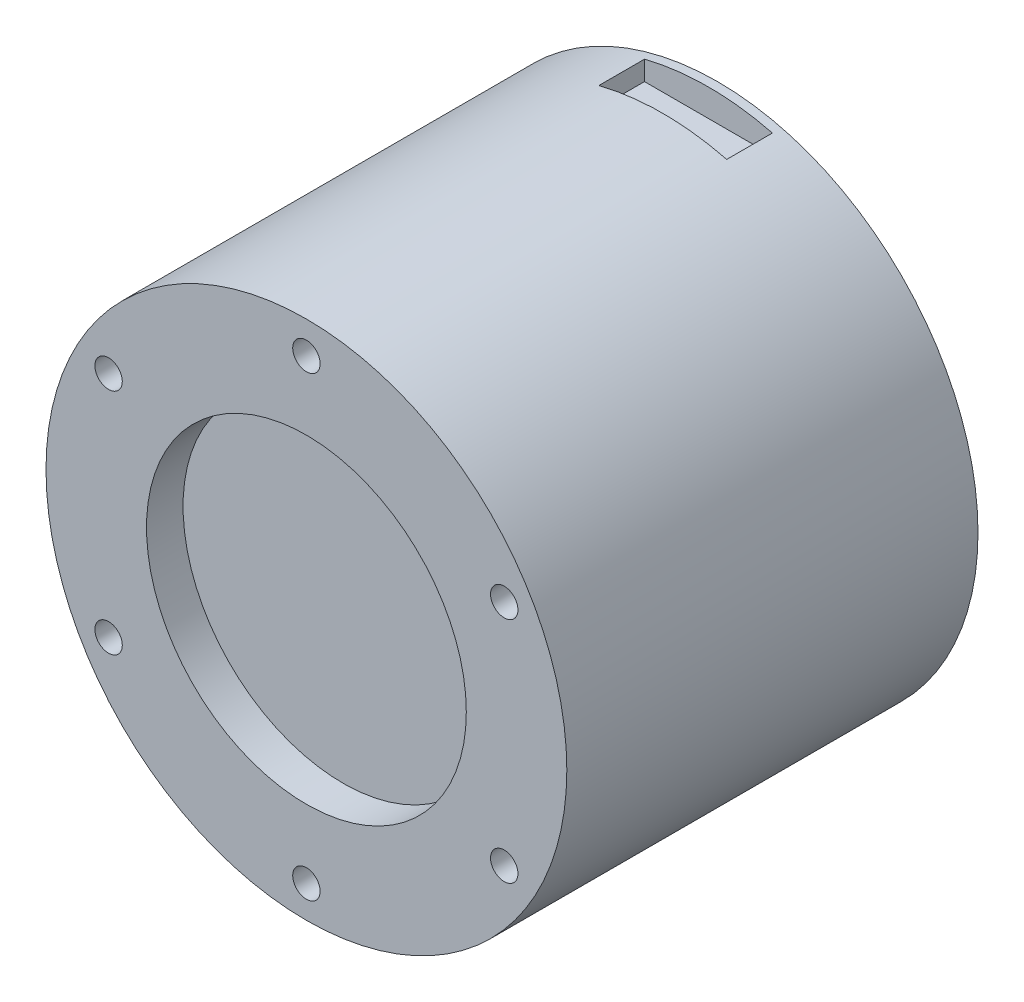
ISO-10303-21;
HEADER;
FILE_DESCRIPTION(('STEP AP214'),'2;1');
FILE_NAME('part.step','',(''),(''),'','','');
FILE_SCHEMA(('AUTOMOTIVE_DESIGN { 1 0 10303 214 1 1 1 1 }'));
ENDSEC;
DATA;
#1=APPLICATION_CONTEXT('core data for automotive mechanical design processes');
#2=APPLICATION_PROTOCOL_DEFINITION('international standard','automotive_design',2000,#1);
#3=PRODUCT_CONTEXT('',#1,'mechanical');
#4=PRODUCT('Part','Part','',(#3));
#5=PRODUCT_RELATED_PRODUCT_CATEGORY('part','',(#4));
#6=PRODUCT_DEFINITION_FORMATION('','',#4);
#7=PRODUCT_DEFINITION_CONTEXT('part definition',#1,'design');
#8=PRODUCT_DEFINITION('design','',#6,#7);
#9=PRODUCT_DEFINITION_SHAPE('','',#8);
#10=(LENGTH_UNIT() NAMED_UNIT(*) SI_UNIT(.MILLI.,.METRE.));
#11=(NAMED_UNIT(*) PLANE_ANGLE_UNIT() SI_UNIT($,.RADIAN.));
#12=(NAMED_UNIT(*) SI_UNIT($,.STERADIAN.) SOLID_ANGLE_UNIT());
#13=UNCERTAINTY_MEASURE_WITH_UNIT(LENGTH_MEASURE(1.E-05),#10,'distance_accuracy_value','');
#14=(GEOMETRIC_REPRESENTATION_CONTEXT(3) GLOBAL_UNCERTAINTY_ASSIGNED_CONTEXT((#13)) GLOBAL_UNIT_ASSIGNED_CONTEXT((#10,
#11,#12)) REPRESENTATION_CONTEXT('',''));
#15=CARTESIAN_POINT('',(0.,0.,0.));
#16=DIRECTION('',(0.,0.,1.));
#17=DIRECTION('',(1.,0.,0.));
#18=AXIS2_PLACEMENT_3D('',#15,#16,#17);
#19=CARTESIAN_POINT('',(0.,0.,45.));
#20=DIRECTION('',(0.,0.,-1.));
#21=DIRECTION('',(-1.,0.,0.));
#22=AXIS2_PLACEMENT_3D('',#19,#20,#21);
#23=CYLINDRICAL_SURFACE('',#22,28.5);
#24=CARTESIAN_POINT('',(6.99999999976047,27.6269795671433,-4.8311518948453));
#25=CARTESIAN_POINT('',(6.99999999986288,27.6269795671173,-2.0541012632302));
#26=CARTESIAN_POINT('',(6.99999999996529,27.6269795670914,0.722949368384905));
#27=CARTESIAN_POINT('',(7.00000000017012,27.6269795670395,6.27705063161511));
#28=CARTESIAN_POINT('',(7.00000000027253,27.6269795670136,9.0541012632302));
#29=CARTESIAN_POINT('',(7.00000000037494,27.6269795669876,11.8311518948453));
#30=B_SPLINE_CURVE_WITH_KNOTS('',3,(#24,#25,#26,#27,#28,#29),.UNSPECIFIED.,.F.,.F.,(4,2,4),(0.,
8.3311518948453,16.6623037896906),.UNSPECIFIED.);
#31=CARTESIAN_POINT('',(6.99999999997551,27.6269795670888,1.));
#32=VERTEX_POINT('',#31);
#33=CARTESIAN_POINT('',(7.0000000001599,27.6269795670421,6.00000000000001));
#34=VERTEX_POINT('',#33);
#35=EDGE_CURVE('E278',#32,#34,#30,.T.);
#36=ORIENTED_EDGE('',*,*,#35,.T.);
#37=CARTESIAN_POINT('',(0.,0.,6.00000000000001));
#38=DIRECTION('',(0.,0.,1.));
#39=DIRECTION('',(1.,0.,0.));
#40=AXIS2_PLACEMENT_3D('',#37,#38,#39);
#41=CIRCLE('',#40,28.5);
#42=CARTESIAN_POINT('',(-6.9999999998401,27.6269795671231,6.));
#43=VERTEX_POINT('',#42);
#44=EDGE_CURVE('E269',#34,#43,#41,.T.);
#45=ORIENTED_EDGE('',*,*,#44,.T.);
#46=DIRECTION('',(0.,0.,-1.));
#47=VECTOR('',#46,1.);
#48=CARTESIAN_POINT('',(-6.99999999984012,27.6269795671231,45.));
#49=LINE('',#48,#47);
#50=CARTESIAN_POINT('',(-6.99999999984012,27.6269795671231,1.00000000000001));
#51=VERTEX_POINT('',#50);
#52=EDGE_CURVE('E275',#43,#51,#49,.T.);
#53=ORIENTED_EDGE('',*,*,#52,.T.);
#54=CARTESIAN_POINT('',(0.,0.,1.));
#55=DIRECTION('',(0.,0.,-1.));
#56=DIRECTION('',(-1.,0.,0.));
#57=AXIS2_PLACEMENT_3D('',#54,#55,#56);
#58=CIRCLE('',#57,28.5);
#59=EDGE_CURVE('E62',#51,#32,#58,.T.);
#60=ORIENTED_EDGE('',*,*,#59,.T.);
#61=EDGE_LOOP('',(#36,#45,#53,#60));
#62=FACE_BOUND('',#61,.T.);
#63=CARTESIAN_POINT('',(0.,0.,45.));
#64=DIRECTION('',(0.,0.,1.));
#65=DIRECTION('',(1.,0.,0.));
#66=AXIS2_PLACEMENT_3D('',#63,#64,#65);
#67=CIRCLE('',#66,28.5);
#68=CARTESIAN_POINT('',(28.5,0.,45.));
#69=VERTEX_POINT('',#68);
#70=EDGE_CURVE('E266',#69,#69,#67,.T.);
#71=ORIENTED_EDGE('',*,*,#70,.F.);
#72=EDGE_LOOP('',(#71));
#73=FACE_BOUND('',#72,.T.);
#74=CARTESIAN_POINT('',(0.,0.,0.));
#75=DIRECTION('',(0.,0.,1.));
#76=DIRECTION('',(1.,0.,0.));
#77=AXIS2_PLACEMENT_3D('',#74,#75,#76);
#78=CIRCLE('',#77,28.5);
#79=CARTESIAN_POINT('',(28.5,0.,0.));
#80=VERTEX_POINT('',#79);
#81=EDGE_CURVE('E263',#80,#80,#78,.T.);
#82=ORIENTED_EDGE('',*,*,#81,.T.);
#83=EDGE_LOOP('',(#82));
#84=FACE_BOUND('',#83,.T.);
#85=CARTESIAN_POINT('',(0.,0.,6.00000000000001));
#86=DIRECTION('',(0.,0.,-1.));
#87=DIRECTION('',(-1.,0.,0.));
#88=AXIS2_PLACEMENT_3D('',#85,#86,#87);
#89=CIRCLE('',#88,28.5);
#90=CARTESIAN_POINT('',(7.0000000001599,-27.6269795670421,6.));
#91=VERTEX_POINT('',#90);
#92=CARTESIAN_POINT('',(-6.9999999998401,-27.6269795671231,6.00000000000001));
#93=VERTEX_POINT('',#92);
#94=EDGE_CURVE('E286',#91,#93,#89,.T.);
#95=ORIENTED_EDGE('',*,*,#94,.F.);
#96=CARTESIAN_POINT('',(6.99999999976047,-27.6269795671433,-4.8311518948453));
#97=CARTESIAN_POINT('',(6.99999999986288,-27.6269795671173,-2.0541012632302));
#98=CARTESIAN_POINT('',(6.99999999996529,-27.6269795670914,0.722949368384905));
#99=CARTESIAN_POINT('',(7.00000000017012,-27.6269795670395,6.27705063161511));
#100=CARTESIAN_POINT('',(7.00000000027253,-27.6269795670136,9.0541012632302));
#101=CARTESIAN_POINT('',(7.00000000037494,-27.6269795669876,11.8311518948453));
#102=B_SPLINE_CURVE_WITH_KNOTS('',3,(#96,#97,#98,#99,#100,#101),.UNSPECIFIED.,.F.,.F.,(4,2,4),
(0.,8.3311518948453,16.6623037896906),.UNSPECIFIED.);
#103=CARTESIAN_POINT('',(6.99999999997551,-27.6269795670888,1.));
#104=VERTEX_POINT('',#103);
#105=EDGE_CURVE('E423',#104,#91,#102,.T.);
#106=ORIENTED_EDGE('',*,*,#105,.F.);
#107=CARTESIAN_POINT('',(0.,0.,1.));
#108=DIRECTION('',(0.,0.,1.));
#109=DIRECTION('',(1.,0.,0.));
#110=AXIS2_PLACEMENT_3D('',#107,#108,#109);
#111=CIRCLE('',#110,28.5);
#112=CARTESIAN_POINT('',(-6.9999999998401,-27.6269795671231,1.));
#113=VERTEX_POINT('',#112);
#114=EDGE_CURVE('E440',#113,#104,#111,.T.);
#115=ORIENTED_EDGE('',*,*,#114,.F.);
#116=DIRECTION('',(0.,0.,-1.));
#117=VECTOR('',#116,1.);
#118=CARTESIAN_POINT('',(-6.99999999984012,-27.6269795671231,45.));
#119=LINE('',#118,#117);
#120=EDGE_CURVE('E462',#93,#113,#119,.T.);
#121=ORIENTED_EDGE('',*,*,#120,.F.);
#122=EDGE_LOOP('',(#95,#106,#115,#121));
#123=FACE_BOUND('',#122,.T.);
#124=CARTESIAN_POINT('',(0.,0.,1.));
#125=DIRECTION('',(0.,0.,1.));
#126=DIRECTION('',(0.,-1.,0.));
#127=AXIS2_PLACEMENT_3D('',#124,#125,#126);
#128=CIRCLE('',#127,28.5);
#129=CARTESIAN_POINT('',(-28.2179021190449,4.,1.));
#130=VERTEX_POINT('',#129);
#131=CARTESIAN_POINT('',(-28.2179021190449,-4.,1.));
#132=VERTEX_POINT('',#131);
#133=EDGE_CURVE('E418',#130,#132,#128,.T.);
#134=ORIENTED_EDGE('',*,*,#133,.F.);
#135=DIRECTION('',(0.,0.,-1.));
#136=VECTOR('',#135,1.);
#137=CARTESIAN_POINT('',(-28.2179021190449,4.,45.));
#138=LINE('',#137,#136);
#139=CARTESIAN_POINT('',(-28.2179021190449,4.,9.));
#140=VERTEX_POINT('',#139);
#141=EDGE_CURVE('E11',#140,#130,#138,.T.);
#142=ORIENTED_EDGE('',*,*,#141,.F.);
#143=CARTESIAN_POINT('',(0.,0.,9.));
#144=DIRECTION('',(0.,0.,-1.));
#145=DIRECTION('',(-1.,0.,0.));
#146=AXIS2_PLACEMENT_3D('',#143,#144,#145);
#147=CIRCLE('',#146,28.5);
#148=CARTESIAN_POINT('',(-28.2179021190449,-4.,9.));
#149=VERTEX_POINT('',#148);
#150=EDGE_CURVE('E47',#149,#140,#147,.T.);
#151=ORIENTED_EDGE('',*,*,#150,.F.);
#152=DIRECTION('',(0.,0.,-1.));
#153=VECTOR('',#152,1.);
#154=CARTESIAN_POINT('',(-28.2179021190449,-4.,45.));
#155=LINE('',#154,#153);
#156=EDGE_CURVE('E419',#132,#149,#155,.F.);
#157=ORIENTED_EDGE('',*,*,#156,.F.);
#158=EDGE_LOOP('',(#134,#142,#151,#157));
#159=FACE_BOUND('',#158,.T.);
#160=ADVANCED_FACE('F39',(#62,#73,#84,#123,#159),#23,.T.);
#161=CARTESIAN_POINT('',(0.,0.,45.));
#162=DIRECTION('',(0.,0.,1.));
#163=DIRECTION('',(1.,0.,0.));
#164=AXIS2_PLACEMENT_3D('',#161,#162,#163);
#165=PLANE('',#164);
#166=CARTESIAN_POINT('',(0.,25.,45.));
#167=DIRECTION('',(0.,0.,1.));
#168=DIRECTION('',(1.,0.,0.));
#169=AXIS2_PLACEMENT_3D('',#166,#167,#168);
#170=CIRCLE('',#169,1.5);
#171=CARTESIAN_POINT('',(1.5,25.,45.));
#172=VERTEX_POINT('',#171);
#173=EDGE_CURVE('E228',#172,#172,#170,.T.);
#174=ORIENTED_EDGE('',*,*,#173,.F.);
#175=EDGE_LOOP('',(#174));
#176=FACE_BOUND('',#175,.T.);
#177=CARTESIAN_POINT('',(-21.6506350946105,12.4999999999991,45.));
#178=DIRECTION('',(0.,0.,1.));
#179=DIRECTION('',(1.,0.,0.));
#180=AXIS2_PLACEMENT_3D('',#177,#178,#179);
#181=CIRCLE('',#180,1.5);
#182=CARTESIAN_POINT('',(-20.1506350946105,12.4999999999991,45.));
#183=VERTEX_POINT('',#182);
#184=EDGE_CURVE('E232',#183,#183,#181,.T.);
#185=ORIENTED_EDGE('',*,*,#184,.F.);
#186=EDGE_LOOP('',(#185));
#187=FACE_BOUND('',#186,.T.);
#188=CARTESIAN_POINT('',(-21.6506350946095,-12.5000000000009,45.));
#189=DIRECTION('',(0.,0.,1.));
#190=DIRECTION('',(1.,0.,0.));
#191=AXIS2_PLACEMENT_3D('',#188,#189,#190);
#192=CIRCLE('',#191,1.5);
#193=CARTESIAN_POINT('',(-20.1506350946095,-12.5000000000009,45.));
#194=VERTEX_POINT('',#193);
#195=EDGE_CURVE('E255',#194,#194,#192,.T.);
#196=ORIENTED_EDGE('',*,*,#195,.F.);
#197=EDGE_LOOP('',(#196));
#198=FACE_BOUND('',#197,.T.);
#199=CARTESIAN_POINT('',(2.01647426932225E-12,-25.,45.));
#200=DIRECTION('',(0.,0.,1.));
#201=DIRECTION('',(1.,0.,0.));
#202=AXIS2_PLACEMENT_3D('',#199,#200,#201);
#203=CIRCLE('',#202,1.5);
#204=CARTESIAN_POINT('',(1.50000000000202,-25.,45.));
#205=VERTEX_POINT('',#204);
#206=EDGE_CURVE('E249',#205,#205,#203,.T.);
#207=ORIENTED_EDGE('',*,*,#206,.F.);
#208=EDGE_LOOP('',(#207));
#209=FACE_BOUND('',#208,.T.);
#210=CARTESIAN_POINT('',(21.6506350946125,-12.4999999999991,45.));
#211=DIRECTION('',(0.,0.,1.));
#212=DIRECTION('',(1.,0.,0.));
#213=AXIS2_PLACEMENT_3D('',#210,#211,#212);
#214=CIRCLE('',#213,1.5);
#215=CARTESIAN_POINT('',(23.1506350946125,-12.4999999999991,45.));
#216=VERTEX_POINT('',#215);
#217=EDGE_CURVE('E243',#216,#216,#214,.T.);
#218=ORIENTED_EDGE('',*,*,#217,.F.);
#219=EDGE_LOOP('',(#218));
#220=FACE_BOUND('',#219,.T.);
#221=CARTESIAN_POINT('',(21.6506350946115,12.5000000000009,45.));
#222=DIRECTION('',(0.,0.,1.));
#223=DIRECTION('',(1.,0.,0.));
#224=AXIS2_PLACEMENT_3D('',#221,#222,#223);
#225=CIRCLE('',#224,1.5);
#226=CARTESIAN_POINT('',(23.1506350946115,12.5000000000009,45.));
#227=VERTEX_POINT('',#226);
#228=EDGE_CURVE('E231',#227,#227,#225,.T.);
#229=ORIENTED_EDGE('',*,*,#228,.F.);
#230=EDGE_LOOP('',(#229));
#231=FACE_BOUND('',#230,.T.);
#232=CARTESIAN_POINT('',(0.,0.,45.));
#233=DIRECTION('',(0.,0.,1.));
#234=DIRECTION('',(1.,0.,0.));
#235=AXIS2_PLACEMENT_3D('',#232,#233,#234);
#236=CIRCLE('',#235,17.5);
#237=CARTESIAN_POINT('',(17.5,0.,45.));
#238=VERTEX_POINT('',#237);
#239=EDGE_CURVE('E227',#238,#238,#236,.T.);
#240=ORIENTED_EDGE('',*,*,#239,.F.);
#241=EDGE_LOOP('',(#240));
#242=FACE_BOUND('',#241,.T.);
#243=ORIENTED_EDGE('',*,*,#70,.T.);
#244=EDGE_LOOP('',(#243));
#245=FACE_BOUND('',#244,.T.);
#246=ADVANCED_FACE('F396',(#176,#187,#198,#209,#220,#231,#242,#245),#165,.T.);
#247=CARTESIAN_POINT('',(0.,0.,0.));
#248=DIRECTION('',(0.,0.,1.));
#249=DIRECTION('',(1.,0.,0.));
#250=AXIS2_PLACEMENT_3D('',#247,#248,#249);
#251=PLANE('',#250);
#252=CARTESIAN_POINT('',(13.4350288425436,-13.4350288425444,0.));
#253=DIRECTION('',(0.,0.,-1.));
#254=DIRECTION('',(-1.,0.,0.));
#255=AXIS2_PLACEMENT_3D('',#252,#253,#254);
#256=CIRCLE('',#255,1.5000000000004);
#257=CARTESIAN_POINT('',(11.9350288425432,-13.4350288425444,0.));
#258=VERTEX_POINT('',#257);
#259=EDGE_CURVE('E213',#258,#258,#256,.T.);
#260=ORIENTED_EDGE('',*,*,#259,.F.);
#261=EDGE_LOOP('',(#260));
#262=FACE_BOUND('',#261,.T.);
#263=CARTESIAN_POINT('',(-13.4350288425452,-13.4350288425436,0.));
#264=DIRECTION('',(0.,0.,-1.));
#265=DIRECTION('',(-1.,0.,0.));
#266=AXIS2_PLACEMENT_3D('',#263,#264,#265);
#267=CIRCLE('',#266,1.50000000000106);
#268=CARTESIAN_POINT('',(-14.9350288425462,-13.4350288425436,0.));
#269=VERTEX_POINT('',#268);
#270=EDGE_CURVE('E207',#269,#269,#267,.T.);
#271=ORIENTED_EDGE('',*,*,#270,.F.);
#272=EDGE_LOOP('',(#271));
#273=FACE_BOUND('',#272,.T.);
#274=CARTESIAN_POINT('',(-13.4350288425444,13.4350288425452,0.));
#275=DIRECTION('',(0.,0.,-1.));
#276=DIRECTION('',(-1.,0.,0.));
#277=AXIS2_PLACEMENT_3D('',#274,#275,#276);
#278=CIRCLE('',#277,1.50000000000078);
#279=CARTESIAN_POINT('',(-14.9350288425452,13.4350288425452,0.));
#280=VERTEX_POINT('',#279);
#281=EDGE_CURVE('E200',#280,#280,#278,.T.);
#282=ORIENTED_EDGE('',*,*,#281,.F.);
#283=EDGE_LOOP('',(#282));
#284=FACE_BOUND('',#283,.T.);
#285=CARTESIAN_POINT('',(13.4350288425444,13.4350288425444,0.));
#286=DIRECTION('',(0.,0.,-1.));
#287=DIRECTION('',(-1.,0.,0.));
#288=AXIS2_PLACEMENT_3D('',#285,#286,#287);
#289=CIRCLE('',#288,1.5);
#290=CARTESIAN_POINT('',(11.9350288425444,13.4350288425444,0.));
#291=VERTEX_POINT('',#290);
#292=EDGE_CURVE('E203',#291,#291,#289,.T.);
#293=ORIENTED_EDGE('',*,*,#292,.F.);
#294=EDGE_LOOP('',(#293));
#295=FACE_BOUND('',#294,.T.);
#296=ORIENTED_EDGE('',*,*,#81,.F.);
#297=EDGE_LOOP('',(#296));
#298=FACE_BOUND('',#297,.T.);
#299=ADVANCED_FACE('F394',(#262,#273,#284,#295,#298),#251,.F.);
#300=CARTESIAN_POINT('',(0.,0.,41.));
#301=DIRECTION('',(0.,0.,1.));
#302=DIRECTION('',(1.,0.,0.));
#303=AXIS2_PLACEMENT_3D('',#300,#301,#302);
#304=CYLINDRICAL_SURFACE('',#303,17.5);
#305=CARTESIAN_POINT('',(0.,0.,41.));
#306=DIRECTION('',(0.,0.,1.));
#307=DIRECTION('',(1.,0.,0.));
#308=AXIS2_PLACEMENT_3D('',#305,#306,#307);
#309=CIRCLE('',#308,17.5);
#310=CARTESIAN_POINT('',(17.5,0.,41.));
#311=VERTEX_POINT('',#310);
#312=EDGE_CURVE('E260',#311,#311,#309,.T.);
#313=ORIENTED_EDGE('',*,*,#312,.F.);
#314=EDGE_LOOP('',(#313));
#315=FACE_BOUND('',#314,.T.);
#316=ORIENTED_EDGE('',*,*,#239,.T.);
#317=EDGE_LOOP('',(#316));
#318=FACE_BOUND('',#317,.T.);
#319=ADVANCED_FACE('F390',(#315,#318),#304,.F.);
#320=CARTESIAN_POINT('',(0.,0.,41.));
#321=DIRECTION('',(0.,0.,1.));
#322=DIRECTION('',(1.,0.,0.));
#323=AXIS2_PLACEMENT_3D('',#320,#321,#322);
#324=PLANE('',#323);
#325=ORIENTED_EDGE('',*,*,#312,.T.);
#326=EDGE_LOOP('',(#325));
#327=FACE_BOUND('',#326,.T.);
#328=ADVANCED_FACE('F360',(#327),#324,.T.);
#329=CARTESIAN_POINT('',(21.6506350946115,12.5000000000009,40.));
#330=DIRECTION('',(0.,0.,1.));
#331=DIRECTION('',(1.,0.,0.));
#332=AXIS2_PLACEMENT_3D('',#329,#330,#331);
#333=CYLINDRICAL_SURFACE('',#332,1.5);
#334=CARTESIAN_POINT('',(21.6506350946115,12.5000000000009,40.));
#335=DIRECTION('',(0.,0.,1.));
#336=DIRECTION('',(1.,0.,0.));
#337=AXIS2_PLACEMENT_3D('',#334,#335,#336);
#338=CIRCLE('',#337,1.5);
#339=CARTESIAN_POINT('',(23.1506350946115,12.5000000000009,40.));
#340=VERTEX_POINT('',#339);
#341=EDGE_CURVE('E240',#340,#340,#338,.T.);
#342=ORIENTED_EDGE('',*,*,#341,.F.);
#343=EDGE_LOOP('',(#342));
#344=FACE_BOUND('',#343,.T.);
#345=ORIENTED_EDGE('',*,*,#228,.T.);
#346=EDGE_LOOP('',(#345));
#347=FACE_BOUND('',#346,.T.);
#348=ADVANCED_FACE('F356',(#344,#347),#333,.F.);
#349=CARTESIAN_POINT('',(21.6506350946115,12.5000000000009,40.));
#350=DIRECTION('',(0.,0.,1.));
#351=DIRECTION('',(1.,0.,0.));
#352=AXIS2_PLACEMENT_3D('',#349,#350,#351);
#353=PLANE('',#352);
#354=ORIENTED_EDGE('',*,*,#341,.T.);
#355=EDGE_LOOP('',(#354));
#356=FACE_BOUND('',#355,.T.);
#357=ADVANCED_FACE('F359',(#356),#353,.T.);
#358=CARTESIAN_POINT('',(21.6506350946125,-12.4999999999991,40.));
#359=DIRECTION('',(0.,0.,1.));
#360=DIRECTION('',(1.,0.,0.));
#361=AXIS2_PLACEMENT_3D('',#358,#359,#360);
#362=CYLINDRICAL_SURFACE('',#361,1.5);
#363=CARTESIAN_POINT('',(21.6506350946125,-12.4999999999991,40.));
#364=DIRECTION('',(0.,0.,1.));
#365=DIRECTION('',(1.,0.,0.));
#366=AXIS2_PLACEMENT_3D('',#363,#364,#365);
#367=CIRCLE('',#366,1.5);
#368=CARTESIAN_POINT('',(23.1506350946125,-12.4999999999991,40.));
#369=VERTEX_POINT('',#368);
#370=EDGE_CURVE('E246',#369,#369,#367,.T.);
#371=ORIENTED_EDGE('',*,*,#370,.F.);
#372=EDGE_LOOP('',(#371));
#373=FACE_BOUND('',#372,.T.);
#374=ORIENTED_EDGE('',*,*,#217,.T.);
#375=EDGE_LOOP('',(#374));
#376=FACE_BOUND('',#375,.T.);
#377=ADVANCED_FACE('F364',(#373,#376),#362,.F.);
#378=CARTESIAN_POINT('',(21.6506350946125,-12.4999999999991,40.));
#379=DIRECTION('',(0.,0.,1.));
#380=DIRECTION('',(1.,0.,0.));
#381=AXIS2_PLACEMENT_3D('',#378,#379,#380);
#382=PLANE('',#381);
#383=ORIENTED_EDGE('',*,*,#370,.T.);
#384=EDGE_LOOP('',(#383));
#385=FACE_BOUND('',#384,.T.);
#386=ADVANCED_FACE('F368',(#385),#382,.T.);
#387=CARTESIAN_POINT('',(2.01647426932225E-12,-25.,40.));
#388=DIRECTION('',(0.,0.,1.));
#389=DIRECTION('',(1.,0.,0.));
#390=AXIS2_PLACEMENT_3D('',#387,#388,#389);
#391=CYLINDRICAL_SURFACE('',#390,1.5);
#392=CARTESIAN_POINT('',(2.01647426932225E-12,-25.,40.));
#393=DIRECTION('',(0.,0.,1.));
#394=DIRECTION('',(1.,0.,0.));
#395=AXIS2_PLACEMENT_3D('',#392,#393,#394);
#396=CIRCLE('',#395,1.5);
#397=CARTESIAN_POINT('',(1.50000000000202,-25.,40.));
#398=VERTEX_POINT('',#397);
#399=EDGE_CURVE('E252',#398,#398,#396,.T.);
#400=ORIENTED_EDGE('',*,*,#399,.F.);
#401=EDGE_LOOP('',(#400));
#402=FACE_BOUND('',#401,.T.);
#403=ORIENTED_EDGE('',*,*,#206,.T.);
#404=EDGE_LOOP('',(#403));
#405=FACE_BOUND('',#404,.T.);
#406=ADVANCED_FACE('F372',(#402,#405),#391,.F.);
#407=CARTESIAN_POINT('',(2.01647426932225E-12,-25.,40.));
#408=DIRECTION('',(0.,0.,1.));
#409=DIRECTION('',(1.,0.,0.));
#410=AXIS2_PLACEMENT_3D('',#407,#408,#409);
#411=PLANE('',#410);
#412=ORIENTED_EDGE('',*,*,#399,.T.);
#413=EDGE_LOOP('',(#412));
#414=FACE_BOUND('',#413,.T.);
#415=ADVANCED_FACE('F376',(#414),#411,.T.);
#416=CARTESIAN_POINT('',(-21.6506350946095,-12.5000000000009,40.));
#417=DIRECTION('',(0.,0.,1.));
#418=DIRECTION('',(1.,0.,0.));
#419=AXIS2_PLACEMENT_3D('',#416,#417,#418);
#420=CYLINDRICAL_SURFACE('',#419,1.5);
#421=CARTESIAN_POINT('',(-21.6506350946095,-12.5000000000009,40.));
#422=DIRECTION('',(0.,0.,1.));
#423=DIRECTION('',(1.,0.,0.));
#424=AXIS2_PLACEMENT_3D('',#421,#422,#423);
#425=CIRCLE('',#424,1.5);
#426=CARTESIAN_POINT('',(-20.1506350946095,-12.5000000000009,40.));
#427=VERTEX_POINT('',#426);
#428=EDGE_CURVE('E235',#427,#427,#425,.T.);
#429=ORIENTED_EDGE('',*,*,#428,.F.);
#430=EDGE_LOOP('',(#429));
#431=FACE_BOUND('',#430,.T.);
#432=ORIENTED_EDGE('',*,*,#195,.T.);
#433=EDGE_LOOP('',(#432));
#434=FACE_BOUND('',#433,.T.);
#435=ADVANCED_FACE('F380',(#431,#434),#420,.F.);
#436=CARTESIAN_POINT('',(-21.6506350946095,-12.5000000000009,40.));
#437=DIRECTION('',(0.,0.,1.));
#438=DIRECTION('',(1.,0.,0.));
#439=AXIS2_PLACEMENT_3D('',#436,#437,#438);
#440=PLANE('',#439);
#441=ORIENTED_EDGE('',*,*,#428,.T.);
#442=EDGE_LOOP('',(#441));
#443=FACE_BOUND('',#442,.T.);
#444=ADVANCED_FACE('F351',(#443),#440,.T.);
#445=CARTESIAN_POINT('',(-21.6506350946105,12.4999999999991,40.));
#446=DIRECTION('',(0.,0.,1.));
#447=DIRECTION('',(1.,0.,0.));
#448=AXIS2_PLACEMENT_3D('',#445,#446,#447);
#449=CYLINDRICAL_SURFACE('',#448,1.5);
#450=CARTESIAN_POINT('',(-21.6506350946105,12.4999999999991,40.));
#451=DIRECTION('',(0.,0.,1.));
#452=DIRECTION('',(1.,0.,0.));
#453=AXIS2_PLACEMENT_3D('',#450,#451,#452);
#454=CIRCLE('',#453,1.5);
#455=CARTESIAN_POINT('',(-20.1506350946105,12.4999999999991,40.));
#456=VERTEX_POINT('',#455);
#457=EDGE_CURVE('E221',#456,#456,#454,.T.);
#458=ORIENTED_EDGE('',*,*,#457,.F.);
#459=EDGE_LOOP('',(#458));
#460=FACE_BOUND('',#459,.T.);
#461=ORIENTED_EDGE('',*,*,#184,.T.);
#462=EDGE_LOOP('',(#461));
#463=FACE_BOUND('',#462,.T.);
#464=ADVANCED_FACE('F348',(#460,#463),#449,.F.);
#465=CARTESIAN_POINT('',(-21.6506350946105,12.4999999999991,40.));
#466=DIRECTION('',(0.,0.,1.));
#467=DIRECTION('',(1.,0.,0.));
#468=AXIS2_PLACEMENT_3D('',#465,#466,#467);
#469=PLANE('',#468);
#470=ORIENTED_EDGE('',*,*,#457,.T.);
#471=EDGE_LOOP('',(#470));
#472=FACE_BOUND('',#471,.T.);
#473=ADVANCED_FACE('F346',(#472),#469,.T.);
#474=CARTESIAN_POINT('',(0.,25.,40.));
#475=DIRECTION('',(0.,0.,1.));
#476=DIRECTION('',(1.,0.,0.));
#477=AXIS2_PLACEMENT_3D('',#474,#475,#476);
#478=CYLINDRICAL_SURFACE('',#477,1.5);
#479=CARTESIAN_POINT('',(0.,25.,40.));
#480=DIRECTION('',(0.,0.,1.));
#481=DIRECTION('',(1.,0.,0.));
#482=AXIS2_PLACEMENT_3D('',#479,#480,#481);
#483=CIRCLE('',#482,1.5);
#484=CARTESIAN_POINT('',(1.5,25.,40.));
#485=VERTEX_POINT('',#484);
#486=EDGE_CURVE('E224',#485,#485,#483,.T.);
#487=ORIENTED_EDGE('',*,*,#486,.F.);
#488=EDGE_LOOP('',(#487));
#489=FACE_BOUND('',#488,.T.);
#490=ORIENTED_EDGE('',*,*,#173,.T.);
#491=EDGE_LOOP('',(#490));
#492=FACE_BOUND('',#491,.T.);
#493=ADVANCED_FACE('F342',(#489,#492),#478,.F.);
#494=CARTESIAN_POINT('',(0.,25.,40.));
#495=DIRECTION('',(0.,0.,1.));
#496=DIRECTION('',(1.,0.,0.));
#497=AXIS2_PLACEMENT_3D('',#494,#495,#496);
#498=PLANE('',#497);
#499=ORIENTED_EDGE('',*,*,#486,.T.);
#500=EDGE_LOOP('',(#499));
#501=FACE_BOUND('',#500,.T.);
#502=ADVANCED_FACE('F338',(#501),#498,.T.);
#503=CARTESIAN_POINT('',(13.4350288425444,13.4350288425444,4.));
#504=DIRECTION('',(0.,0.,-1.));
#505=DIRECTION('',(-1.,0.,0.));
#506=AXIS2_PLACEMENT_3D('',#503,#504,#505);
#507=CYLINDRICAL_SURFACE('',#506,1.5);
#508=CARTESIAN_POINT('',(13.4350288425444,13.4350288425444,4.));
#509=DIRECTION('',(0.,0.,-1.));
#510=DIRECTION('',(-1.,0.,0.));
#511=AXIS2_PLACEMENT_3D('',#508,#509,#510);
#512=CIRCLE('',#511,1.5);
#513=CARTESIAN_POINT('',(11.9350288425444,13.4350288425444,4.));
#514=VERTEX_POINT('',#513);
#515=EDGE_CURVE('E218',#514,#514,#512,.T.);
#516=ORIENTED_EDGE('',*,*,#515,.F.);
#517=EDGE_LOOP('',(#516));
#518=FACE_BOUND('',#517,.T.);
#519=ORIENTED_EDGE('',*,*,#292,.T.);
#520=EDGE_LOOP('',(#519));
#521=FACE_BOUND('',#520,.T.);
#522=ADVANCED_FACE('F334',(#518,#521),#507,.F.);
#523=CARTESIAN_POINT('',(13.4350288425444,13.4350288425444,4.));
#524=DIRECTION('',(0.,0.,-1.));
#525=DIRECTION('',(-1.,0.,0.));
#526=AXIS2_PLACEMENT_3D('',#523,#524,#525);
#527=PLANE('',#526);
#528=ORIENTED_EDGE('',*,*,#515,.T.);
#529=EDGE_LOOP('',(#528));
#530=FACE_BOUND('',#529,.T.);
#531=ADVANCED_FACE('F312',(#530),#527,.T.);
#532=CARTESIAN_POINT('',(-13.4350288425444,13.4350288425452,4.));
#533=DIRECTION('',(0.,0.,-1.));
#534=DIRECTION('',(-1.,0.,0.));
#535=AXIS2_PLACEMENT_3D('',#532,#533,#534);
#536=CYLINDRICAL_SURFACE('',#535,1.50000000000078);
#537=CARTESIAN_POINT('',(-13.4350288425444,13.4350288425452,4.));
#538=DIRECTION('',(0.,0.,-1.));
#539=DIRECTION('',(-1.,0.,0.));
#540=AXIS2_PLACEMENT_3D('',#537,#538,#539);
#541=CIRCLE('',#540,1.50000000000078);
#542=CARTESIAN_POINT('',(-14.9350288425452,13.4350288425452,4.));
#543=VERTEX_POINT('',#542);
#544=EDGE_CURVE('E204',#543,#543,#541,.T.);
#545=ORIENTED_EDGE('',*,*,#544,.F.);
#546=EDGE_LOOP('',(#545));
#547=FACE_BOUND('',#546,.T.);
#548=ORIENTED_EDGE('',*,*,#281,.T.);
#549=EDGE_LOOP('',(#548));
#550=FACE_BOUND('',#549,.T.);
#551=ADVANCED_FACE('F308',(#547,#550),#536,.F.);
#552=CARTESIAN_POINT('',(-13.4350288425444,13.4350288425452,4.));
#553=DIRECTION('',(0.,0.,-1.));
#554=DIRECTION('',(-1.,0.,0.));
#555=AXIS2_PLACEMENT_3D('',#552,#553,#554);
#556=PLANE('',#555);
#557=ORIENTED_EDGE('',*,*,#544,.T.);
#558=EDGE_LOOP('',(#557));
#559=FACE_BOUND('',#558,.T.);
#560=ADVANCED_FACE('F311',(#559),#556,.T.);
#561=CARTESIAN_POINT('',(-13.4350288425452,-13.4350288425436,4.));
#562=DIRECTION('',(0.,0.,-1.));
#563=DIRECTION('',(-1.,0.,0.));
#564=AXIS2_PLACEMENT_3D('',#561,#562,#563);
#565=CYLINDRICAL_SURFACE('',#564,1.50000000000106);
#566=CARTESIAN_POINT('',(-13.4350288425452,-13.4350288425436,4.));
#567=DIRECTION('',(0.,0.,-1.));
#568=DIRECTION('',(-1.,0.,0.));
#569=AXIS2_PLACEMENT_3D('',#566,#567,#568);
#570=CIRCLE('',#569,1.50000000000106);
#571=CARTESIAN_POINT('',(-14.9350288425462,-13.4350288425436,4.));
#572=VERTEX_POINT('',#571);
#573=EDGE_CURVE('E210',#572,#572,#570,.T.);
#574=ORIENTED_EDGE('',*,*,#573,.F.);
#575=EDGE_LOOP('',(#574));
#576=FACE_BOUND('',#575,.T.);
#577=ORIENTED_EDGE('',*,*,#270,.T.);
#578=EDGE_LOOP('',(#577));
#579=FACE_BOUND('',#578,.T.);
#580=ADVANCED_FACE('F316',(#576,#579),#565,.F.);
#581=CARTESIAN_POINT('',(-13.4350288425452,-13.4350288425436,4.));
#582=DIRECTION('',(0.,0.,-1.));
#583=DIRECTION('',(-1.,0.,0.));
#584=AXIS2_PLACEMENT_3D('',#581,#582,#583);
#585=PLANE('',#584);
#586=ORIENTED_EDGE('',*,*,#573,.T.);
#587=EDGE_LOOP('',(#586));
#588=FACE_BOUND('',#587,.T.);
#589=ADVANCED_FACE('F320',(#588),#585,.T.);
#590=CARTESIAN_POINT('',(13.4350288425436,-13.4350288425444,4.));
#591=DIRECTION('',(0.,0.,-1.));
#592=DIRECTION('',(-1.,0.,0.));
#593=AXIS2_PLACEMENT_3D('',#590,#591,#592);
#594=CYLINDRICAL_SURFACE('',#593,1.5000000000004);
#595=CARTESIAN_POINT('',(13.4350288425436,-13.4350288425444,4.));
#596=DIRECTION('',(0.,0.,-1.));
#597=DIRECTION('',(-1.,0.,0.));
#598=AXIS2_PLACEMENT_3D('',#595,#596,#597);
#599=CIRCLE('',#598,1.5000000000004);
#600=CARTESIAN_POINT('',(11.9350288425432,-13.4350288425444,4.));
#601=VERTEX_POINT('',#600);
#602=EDGE_CURVE('E192',#601,#601,#599,.T.);
#603=ORIENTED_EDGE('',*,*,#602,.F.);
#604=EDGE_LOOP('',(#603));
#605=FACE_BOUND('',#604,.T.);
#606=ORIENTED_EDGE('',*,*,#259,.T.);
#607=EDGE_LOOP('',(#606));
#608=FACE_BOUND('',#607,.T.);
#609=ADVANCED_FACE('F324',(#605,#608),#594,.F.);
#610=CARTESIAN_POINT('',(13.4350288425436,-13.4350288425444,4.));
#611=DIRECTION('',(0.,0.,-1.));
#612=DIRECTION('',(-1.,0.,0.));
#613=AXIS2_PLACEMENT_3D('',#610,#611,#612);
#614=PLANE('',#613);
#615=ORIENTED_EDGE('',*,*,#602,.T.);
#616=EDGE_LOOP('',(#615));
#617=FACE_BOUND('',#616,.T.);
#618=ADVANCED_FACE('F307',(#617),#614,.T.);
#619=CARTESIAN_POINT('',(-6.9999999998401,25.5,1.));
#620=DIRECTION('',(0.,0.,-1.));
#621=DIRECTION('',(-1.,0.,0.));
#622=AXIS2_PLACEMENT_3D('',#619,#620,#621);
#623=PLANE('',#622);
#624=DIRECTION('',(0.,1.,0.));
#625=VECTOR('',#624,1.);
#626=CARTESIAN_POINT('',(-6.9999999998401,25.5,1.));
#627=LINE('',#626,#625);
#628=CARTESIAN_POINT('',(-6.9999999998401,25.5,1.));
#629=VERTEX_POINT('',#628);
#630=EDGE_CURVE('E189',#629,#51,#627,.T.);
#631=ORIENTED_EDGE('',*,*,#630,.F.);
#632=DIRECTION('',(-1.,0.,0.));
#633=VECTOR('',#632,1.);
#634=CARTESIAN_POINT('',(-6.9999999998401,25.5,1.));
#635=LINE('',#634,#633);
#636=CARTESIAN_POINT('',(6.99999999997551,25.5,1.));
#637=VERTEX_POINT('',#636);
#638=EDGE_CURVE('E170',#637,#629,#635,.T.);
#639=ORIENTED_EDGE('',*,*,#638,.F.);
#640=DIRECTION('',(0.,1.,0.));
#641=VECTOR('',#640,1.);
#642=CARTESIAN_POINT('',(6.99999999997551,25.5,1.));
#643=LINE('',#642,#641);
#644=EDGE_CURVE('E190',#637,#32,#643,.T.);
#645=ORIENTED_EDGE('',*,*,#644,.T.);
#646=ORIENTED_EDGE('',*,*,#59,.F.);
#647=EDGE_LOOP('',(#631,#639,#645,#646));
#648=FACE_BOUND('',#647,.T.);
#649=ADVANCED_FACE('F294',(#648),#623,.F.);
#650=CARTESIAN_POINT('',(7.0000000001599,25.5,6.));
#651=DIRECTION('',(1.,0.,-3.68781394310957E-11));
#652=DIRECTION('',(-3.68781394310957E-11,0.,-1.));
#653=AXIS2_PLACEMENT_3D('',#650,#651,#652);
#654=PLANE('',#653);
#655=ORIENTED_EDGE('',*,*,#644,.F.);
#656=DIRECTION('',(-3.68781394310957E-11,0.,-1.));
#657=VECTOR('',#656,1.);
#658=CARTESIAN_POINT('',(7.0000000001599,25.5,6.));
#659=LINE('',#658,#657);
#660=CARTESIAN_POINT('',(7.0000000001599,25.5,6.));
#661=VERTEX_POINT('',#660);
#662=EDGE_CURVE('E186',#661,#637,#659,.T.);
#663=ORIENTED_EDGE('',*,*,#662,.F.);
#664=DIRECTION('',(0.,1.,0.));
#665=VECTOR('',#664,1.);
#666=CARTESIAN_POINT('',(7.0000000001599,25.5,6.));
#667=LINE('',#666,#665);
#668=EDGE_CURVE('E193',#661,#34,#667,.T.);
#669=ORIENTED_EDGE('',*,*,#668,.T.);
#670=ORIENTED_EDGE('',*,*,#35,.F.);
#671=EDGE_LOOP('',(#655,#663,#669,#670));
#672=FACE_BOUND('',#671,.T.);
#673=ADVANCED_FACE('F288',(#672),#654,.F.);
#674=CARTESIAN_POINT('',(-6.9999999998401,25.5,6.));
#675=DIRECTION('',(0.,0.,1.));
#676=DIRECTION('',(1.,0.,0.));
#677=AXIS2_PLACEMENT_3D('',#674,#675,#676);
#678=PLANE('',#677);
#679=ORIENTED_EDGE('',*,*,#668,.F.);
#680=DIRECTION('',(1.,0.,0.));
#681=VECTOR('',#680,1.);
#682=CARTESIAN_POINT('',(-6.9999999998401,25.5,6.));
#683=LINE('',#682,#681);
#684=CARTESIAN_POINT('',(-6.9999999998401,25.5,6.));
#685=VERTEX_POINT('',#684);
#686=EDGE_CURVE('E183',#685,#661,#683,.T.);
#687=ORIENTED_EDGE('',*,*,#686,.F.);
#688=DIRECTION('',(0.,1.,0.));
#689=VECTOR('',#688,1.);
#690=CARTESIAN_POINT('',(-6.9999999998401,25.5,6.));
#691=LINE('',#690,#689);
#692=EDGE_CURVE('E196',#685,#43,#691,.T.);
#693=ORIENTED_EDGE('',*,*,#692,.T.);
#694=ORIENTED_EDGE('',*,*,#44,.F.);
#695=EDGE_LOOP('',(#679,#687,#693,#694));
#696=FACE_BOUND('',#695,.T.);
#697=ADVANCED_FACE('F293',(#696),#678,.F.);
#698=CARTESIAN_POINT('',(-6.9999999998401,25.5,1.));
#699=DIRECTION('',(-1.,0.,0.));
#700=DIRECTION('',(0.,0.,1.));
#701=AXIS2_PLACEMENT_3D('',#698,#699,#700);
#702=PLANE('',#701);
#703=ORIENTED_EDGE('',*,*,#692,.F.);
#704=DIRECTION('',(0.,0.,1.));
#705=VECTOR('',#704,1.);
#706=CARTESIAN_POINT('',(-6.9999999998401,25.5,1.));
#707=LINE('',#706,#705);
#708=EDGE_CURVE('E180',#629,#685,#707,.T.);
#709=ORIENTED_EDGE('',*,*,#708,.F.);
#710=ORIENTED_EDGE('',*,*,#630,.T.);
#711=ORIENTED_EDGE('',*,*,#52,.F.);
#712=EDGE_LOOP('',(#703,#709,#710,#711));
#713=FACE_BOUND('',#712,.T.);
#714=ADVANCED_FACE('F300',(#713),#702,.F.);
#715=CARTESIAN_POINT('',(0.,25.5,0.));
#716=DIRECTION('',(0.,-1.,0.));
#717=DIRECTION('',(0.,0.,-1.));
#718=AXIS2_PLACEMENT_3D('',#715,#716,#717);
#719=PLANE('',#718);
#720=ORIENTED_EDGE('',*,*,#638,.T.);
#721=ORIENTED_EDGE('',*,*,#708,.T.);
#722=ORIENTED_EDGE('',*,*,#686,.T.);
#723=ORIENTED_EDGE('',*,*,#662,.T.);
#724=EDGE_LOOP('',(#720,#721,#722,#723));
#725=FACE_BOUND('',#724,.T.);
#726=ADVANCED_FACE('F296',(#725),#719,.F.);
#727=CARTESIAN_POINT('',(-6.9999999998401,-25.5,1.));
#728=DIRECTION('',(0.,0.,1.));
#729=DIRECTION('',(1.,0.,0.));
#730=AXIS2_PLACEMENT_3D('',#727,#728,#729);
#731=PLANE('',#730);
#732=DIRECTION('',(0.,-1.,0.));
#733=VECTOR('',#732,1.);
#734=CARTESIAN_POINT('',(-6.9999999998401,-25.5,1.));
#735=LINE('',#734,#733);
#736=CARTESIAN_POINT('',(-6.9999999998401,-25.5,1.));
#737=VERTEX_POINT('',#736);
#738=EDGE_CURVE('E167',#737,#113,#735,.T.);
#739=ORIENTED_EDGE('',*,*,#738,.T.);
#740=ORIENTED_EDGE('',*,*,#114,.T.);
#741=DIRECTION('',(0.,-1.,0.));
#742=VECTOR('',#741,1.);
#743=CARTESIAN_POINT('',(6.99999999997551,-25.5,1.));
#744=LINE('',#743,#742);
#745=CARTESIAN_POINT('',(6.99999999997551,-25.5,1.));
#746=VERTEX_POINT('',#745);
#747=EDGE_CURVE('E54',#746,#104,#744,.T.);
#748=ORIENTED_EDGE('',*,*,#747,.F.);
#749=DIRECTION('',(-1.,0.,0.));
#750=VECTOR('',#749,1.);
#751=CARTESIAN_POINT('',(-6.9999999998401,-25.5,1.));
#752=LINE('',#751,#750);
#753=EDGE_CURVE('E152',#746,#737,#752,.T.);
#754=ORIENTED_EDGE('',*,*,#753,.T.);
#755=EDGE_LOOP('',(#739,#740,#748,#754));
#756=FACE_BOUND('',#755,.T.);
#757=ADVANCED_FACE('F448',(#756),#731,.T.);
#758=CARTESIAN_POINT('',(-6.9999999998401,-25.5,1.));
#759=DIRECTION('',(1.,0.,0.));
#760=DIRECTION('',(0.,0.,-1.));
#761=AXIS2_PLACEMENT_3D('',#758,#759,#760);
#762=PLANE('',#761);
#763=ORIENTED_EDGE('',*,*,#120,.T.);
#764=ORIENTED_EDGE('',*,*,#738,.F.);
#765=DIRECTION('',(0.,0.,1.));
#766=VECTOR('',#765,1.);
#767=CARTESIAN_POINT('',(-6.9999999998401,-25.5,1.));
#768=LINE('',#767,#766);
#769=CARTESIAN_POINT('',(-6.9999999998401,-25.5,6.));
#770=VERTEX_POINT('',#769);
#771=EDGE_CURVE('E165',#737,#770,#768,.T.);
#772=ORIENTED_EDGE('',*,*,#771,.T.);
#773=DIRECTION('',(0.,-1.,0.));
#774=VECTOR('',#773,1.);
#775=CARTESIAN_POINT('',(-6.9999999998401,-25.5,6.));
#776=LINE('',#775,#774);
#777=EDGE_CURVE('E171',#770,#93,#776,.T.);
#778=ORIENTED_EDGE('',*,*,#777,.T.);
#779=EDGE_LOOP('',(#763,#764,#772,#778));
#780=FACE_BOUND('',#779,.T.);
#781=ADVANCED_FACE('F450',(#780),#762,.T.);
#782=CARTESIAN_POINT('',(-6.9999999998401,-25.5,6.));
#783=DIRECTION('',(0.,0.,-1.));
#784=DIRECTION('',(-1.,0.,0.));
#785=AXIS2_PLACEMENT_3D('',#782,#783,#784);
#786=PLANE('',#785);
#787=DIRECTION('',(0.,-1.,0.));
#788=VECTOR('',#787,1.);
#789=CARTESIAN_POINT('',(7.0000000001599,-25.5,6.));
#790=LINE('',#789,#788);
#791=CARTESIAN_POINT('',(7.0000000001599,-25.5,6.));
#792=VERTEX_POINT('',#791);
#793=EDGE_CURVE('E174',#792,#91,#790,.T.);
#794=ORIENTED_EDGE('',*,*,#793,.T.);
#795=ORIENTED_EDGE('',*,*,#94,.T.);
#796=ORIENTED_EDGE('',*,*,#777,.F.);
#797=DIRECTION('',(1.,0.,0.));
#798=VECTOR('',#797,1.);
#799=CARTESIAN_POINT('',(-6.9999999998401,-25.5,6.));
#800=LINE('',#799,#798);
#801=EDGE_CURVE('E163',#770,#792,#800,.T.);
#802=ORIENTED_EDGE('',*,*,#801,.T.);
#803=EDGE_LOOP('',(#794,#795,#796,#802));
#804=FACE_BOUND('',#803,.T.);
#805=ADVANCED_FACE('F446',(#804),#786,.T.);
#806=CARTESIAN_POINT('',(7.0000000001599,-25.5,6.));
#807=DIRECTION('',(-1.,0.,3.68781394310957E-11));
#808=DIRECTION('',(3.68781394310957E-11,0.,1.));
#809=AXIS2_PLACEMENT_3D('',#806,#807,#808);
#810=PLANE('',#809);
#811=ORIENTED_EDGE('',*,*,#105,.T.);
#812=ORIENTED_EDGE('',*,*,#793,.F.);
#813=DIRECTION('',(-3.68781394310957E-11,0.,-1.));
#814=VECTOR('',#813,1.);
#815=CARTESIAN_POINT('',(7.0000000001599,-25.5,6.));
#816=LINE('',#815,#814);
#817=EDGE_CURVE('E156',#792,#746,#816,.T.);
#818=ORIENTED_EDGE('',*,*,#817,.T.);
#819=ORIENTED_EDGE('',*,*,#747,.T.);
#820=EDGE_LOOP('',(#811,#812,#818,#819));
#821=FACE_BOUND('',#820,.T.);
#822=ADVANCED_FACE('F441',(#821),#810,.T.);
#823=CARTESIAN_POINT('',(0.,-25.5,0.));
#824=DIRECTION('',(0.,1.,0.));
#825=DIRECTION('',(0.,0.,-1.));
#826=AXIS2_PLACEMENT_3D('',#823,#824,#825);
#827=PLANE('',#826);
#828=ORIENTED_EDGE('',*,*,#753,.F.);
#829=ORIENTED_EDGE('',*,*,#817,.F.);
#830=ORIENTED_EDGE('',*,*,#801,.F.);
#831=ORIENTED_EDGE('',*,*,#771,.F.);
#832=EDGE_LOOP('',(#828,#829,#830,#831));
#833=FACE_BOUND('',#832,.T.);
#834=ADVANCED_FACE('F445',(#833),#827,.F.);
#835=CARTESIAN_POINT('',(-25.5,4.,1.));
#836=DIRECTION('',(0.,-1.,0.));
#837=DIRECTION('',(0.,0.,-1.));
#838=AXIS2_PLACEMENT_3D('',#835,#836,#837);
#839=PLANE('',#838);
#840=ORIENTED_EDGE('',*,*,#141,.T.);
#841=DIRECTION('',(-1.,0.,0.));
#842=VECTOR('',#841,1.);
#843=CARTESIAN_POINT('',(-25.5,4.,1.));
#844=LINE('',#843,#842);
#845=CARTESIAN_POINT('',(-25.5,4.,1.));
#846=VERTEX_POINT('',#845);
#847=EDGE_CURVE('E148',#846,#130,#844,.T.);
#848=ORIENTED_EDGE('',*,*,#847,.F.);
#849=DIRECTION('',(0.,0.,1.));
#850=VECTOR('',#849,1.);
#851=CARTESIAN_POINT('',(-25.5,4.,1.));
#852=LINE('',#851,#850);
#853=CARTESIAN_POINT('',(-25.5,4.,9.));
#854=VERTEX_POINT('',#853);
#855=EDGE_CURVE('E134',#846,#854,#852,.T.);
#856=ORIENTED_EDGE('',*,*,#855,.T.);
#857=DIRECTION('',(-1.,0.,0.));
#858=VECTOR('',#857,1.);
#859=CARTESIAN_POINT('',(-25.5,4.,9.));
#860=LINE('',#859,#858);
#861=EDGE_CURVE('E145',#854,#140,#860,.T.);
#862=ORIENTED_EDGE('',*,*,#861,.T.);
#863=EDGE_LOOP('',(#840,#848,#856,#862));
#864=FACE_BOUND('',#863,.T.);
#865=ADVANCED_FACE('F144',(#864),#839,.T.);
#866=CARTESIAN_POINT('',(-25.5,4.,9.));
#867=DIRECTION('',(0.,0.,-1.));
#868=DIRECTION('',(-1.,0.,0.));
#869=AXIS2_PLACEMENT_3D('',#866,#867,#868);
#870=PLANE('',#869);
#871=ORIENTED_EDGE('',*,*,#150,.T.);
#872=ORIENTED_EDGE('',*,*,#861,.F.);
#873=DIRECTION('',(0.,-1.,0.));
#874=VECTOR('',#873,1.);
#875=CARTESIAN_POINT('',(-25.5,4.,9.));
#876=LINE('',#875,#874);
#877=CARTESIAN_POINT('',(-25.5,-4.,9.));
#878=VERTEX_POINT('',#877);
#879=EDGE_CURVE('E130',#854,#878,#876,.T.);
#880=ORIENTED_EDGE('',*,*,#879,.T.);
#881=DIRECTION('',(-1.,0.,0.));
#882=VECTOR('',#881,1.);
#883=CARTESIAN_POINT('',(-25.5,-4.,9.));
#884=LINE('',#883,#882);
#885=EDGE_CURVE('E153',#878,#149,#884,.T.);
#886=ORIENTED_EDGE('',*,*,#885,.T.);
#887=EDGE_LOOP('',(#871,#872,#880,#886));
#888=FACE_BOUND('',#887,.T.);
#889=ADVANCED_FACE('F150',(#888),#870,.T.);
#890=CARTESIAN_POINT('',(-25.5,-4.,9.));
#891=DIRECTION('',(0.,1.,0.));
#892=DIRECTION('',(0.,0.,1.));
#893=AXIS2_PLACEMENT_3D('',#890,#891,#892);
#894=PLANE('',#893);
#895=ORIENTED_EDGE('',*,*,#156,.T.);
#896=ORIENTED_EDGE('',*,*,#885,.F.);
#897=DIRECTION('',(0.,0.,-1.));
#898=VECTOR('',#897,1.);
#899=CARTESIAN_POINT('',(-25.5,-4.,9.));
#900=LINE('',#899,#898);
#901=CARTESIAN_POINT('',(-25.5,-4.,0.999999999999999));
#902=VERTEX_POINT('',#901);
#903=EDGE_CURVE('E135',#878,#902,#900,.T.);
#904=ORIENTED_EDGE('',*,*,#903,.T.);
#905=DIRECTION('',(-1.,0.,0.));
#906=VECTOR('',#905,1.);
#907=CARTESIAN_POINT('',(-25.5,-4.,0.999999999999999));
#908=LINE('',#907,#906);
#909=EDGE_CURVE('E158',#902,#132,#908,.T.);
#910=ORIENTED_EDGE('',*,*,#909,.T.);
#911=EDGE_LOOP('',(#895,#896,#904,#910));
#912=FACE_BOUND('',#911,.T.);
#913=ADVANCED_FACE('F431',(#912),#894,.T.);
#914=CARTESIAN_POINT('',(-25.5,4.,1.));
#915=DIRECTION('',(0.,0.,1.));
#916=DIRECTION('',(0.,-1.,0.));
#917=AXIS2_PLACEMENT_3D('',#914,#915,#916);
#918=PLANE('',#917);
#919=ORIENTED_EDGE('',*,*,#847,.T.);
#920=ORIENTED_EDGE('',*,*,#133,.T.);
#921=ORIENTED_EDGE('',*,*,#909,.F.);
#922=DIRECTION('',(0.,1.,0.));
#923=VECTOR('',#922,1.);
#924=CARTESIAN_POINT('',(-25.5,4.,1.));
#925=LINE('',#924,#923);
#926=EDGE_CURVE('E426',#902,#846,#925,.T.);
#927=ORIENTED_EDGE('',*,*,#926,.T.);
#928=EDGE_LOOP('',(#919,#920,#921,#927));
#929=FACE_BOUND('',#928,.T.);
#930=ADVANCED_FACE('F425',(#929),#918,.T.);
#931=CARTESIAN_POINT('',(-25.5,0.,0.));
#932=DIRECTION('',(1.,0.,0.));
#933=DIRECTION('',(0.,0.,-1.));
#934=AXIS2_PLACEMENT_3D('',#931,#932,#933);
#935=PLANE('',#934);
#936=ORIENTED_EDGE('',*,*,#855,.F.);
#937=ORIENTED_EDGE('',*,*,#926,.F.);
#938=ORIENTED_EDGE('',*,*,#903,.F.);
#939=ORIENTED_EDGE('',*,*,#879,.F.);
#940=EDGE_LOOP('',(#936,#937,#938,#939));
#941=FACE_BOUND('',#940,.T.);
#942=ADVANCED_FACE('F132',(#941),#935,.F.);
#943=CLOSED_SHELL('',(#160,#246,#299,#319,#328,#348,#357,#377,#386,#406,#415,#435,#444,#464,
#473,#493,#502,#522,#531,#551,#560,#580,#589,#609,#618,#649,#673,#697,#714,#726,#757,#781,#805,
#822,#834,#865,#889,#913,#930,#942));
#944=MANIFOLD_SOLID_BREP('B2',#943);
#945=ADVANCED_BREP_SHAPE_REPRESENTATION('',(#18,#944),#14);
#946=SHAPE_DEFINITION_REPRESENTATION(#9,#945);
ENDSEC;
END-ISO-10303-21;
